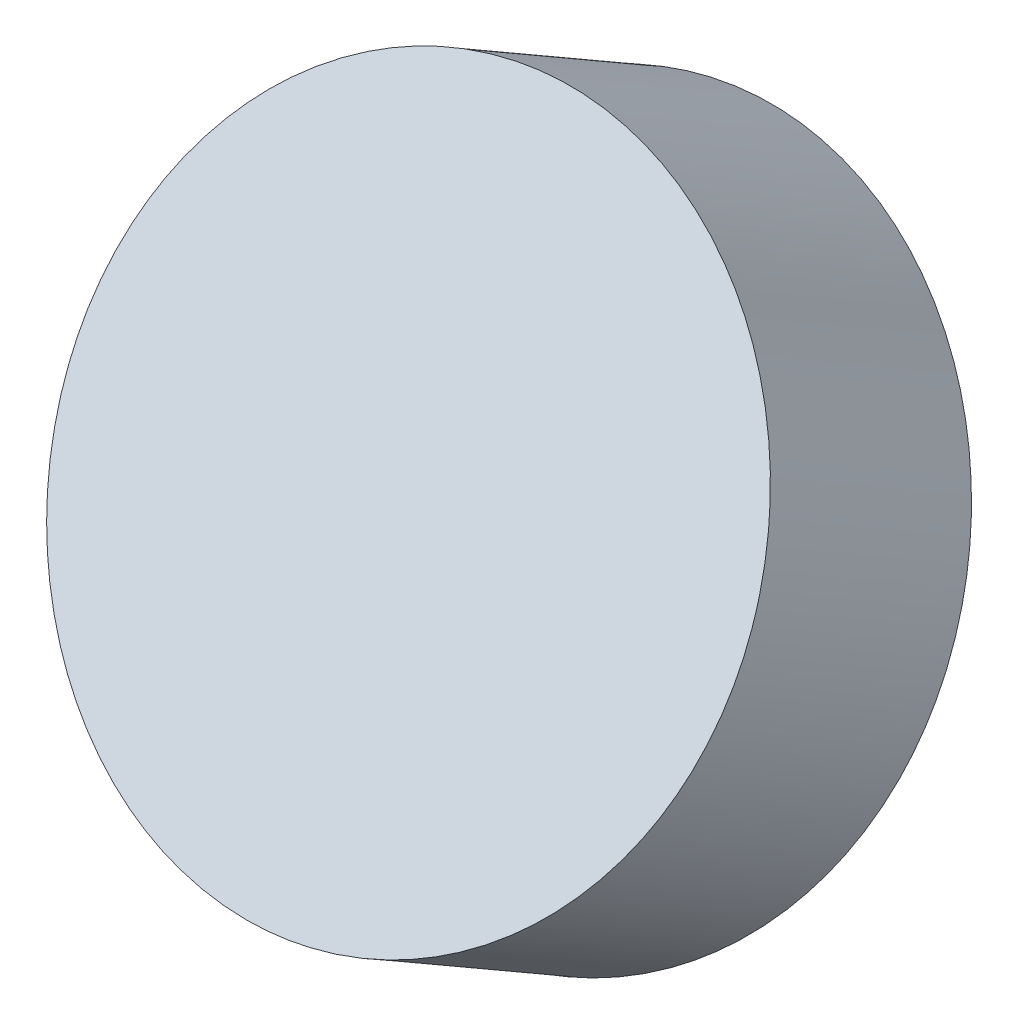
ISO-10303-21;
HEADER;
FILE_DESCRIPTION(('STEP AP214'),'2;1');
FILE_NAME('part.step','',(''),(''),'','','');
FILE_SCHEMA(('AUTOMOTIVE_DESIGN { 1 0 10303 214 1 1 1 1 }'));
ENDSEC;
DATA;
#1=APPLICATION_CONTEXT('core data for automotive mechanical design processes');
#2=APPLICATION_PROTOCOL_DEFINITION('international standard','automotive_design',2000,#1);
#3=PRODUCT_CONTEXT('',#1,'mechanical');
#4=PRODUCT('Part','Part','',(#3));
#5=PRODUCT_RELATED_PRODUCT_CATEGORY('part','',(#4));
#6=PRODUCT_DEFINITION_FORMATION('','',#4);
#7=PRODUCT_DEFINITION_CONTEXT('part definition',#1,'design');
#8=PRODUCT_DEFINITION('design','',#6,#7);
#9=PRODUCT_DEFINITION_SHAPE('','',#8);
#10=(LENGTH_UNIT() NAMED_UNIT(*) SI_UNIT(.MILLI.,.METRE.));
#11=(NAMED_UNIT(*) PLANE_ANGLE_UNIT() SI_UNIT($,.RADIAN.));
#12=(NAMED_UNIT(*) SI_UNIT($,.STERADIAN.) SOLID_ANGLE_UNIT());
#13=UNCERTAINTY_MEASURE_WITH_UNIT(LENGTH_MEASURE(1.E-05),#10,'distance_accuracy_value','');
#14=(GEOMETRIC_REPRESENTATION_CONTEXT(3) GLOBAL_UNCERTAINTY_ASSIGNED_CONTEXT((#13)) GLOBAL_UNIT_ASSIGNED_CONTEXT((#10,
#11,#12)) REPRESENTATION_CONTEXT('',''));
#15=CARTESIAN_POINT('',(0.,0.,0.));
#16=DIRECTION('',(0.,0.,1.));
#17=DIRECTION('',(1.,0.,0.));
#18=AXIS2_PLACEMENT_3D('',#15,#16,#17);
#19=CARTESIAN_POINT('',(12.5,10.6506050496707,41.4329745870571));
#20=CARTESIAN_POINT('',(12.6682299792076,10.6506050496707,41.4329745870571));
#21=CARTESIAN_POINT('',(13.0046899376229,10.7085647064236,41.3995115636287));
#22=CARTESIAN_POINT('',(13.4325454072684,10.9561474133091,41.2565696211617));
#23=CARTESIAN_POINT('',(13.7184292922025,11.3266811191702,41.0426418863389));
#24=CARTESIAN_POINT('',(13.8188183624877,11.763755426186,40.7902969175274));
#25=CARTESIAN_POINT('',(13.7184292922025,12.2008297332018,40.537951948716));
#26=CARTESIAN_POINT('',(13.4325454072684,12.571363439063,40.3240242138933));
#27=CARTESIAN_POINT('',(13.0046899376229,12.8189461459484,40.1810822714262));
#28=CARTESIAN_POINT('',(12.5,12.9058856310778,40.1308877362836));
#29=CARTESIAN_POINT('',(11.9953100623771,12.8189461459484,40.1810822714262));
#30=CARTESIAN_POINT('',(11.5674545927316,12.571363439063,40.3240242138932));
#31=CARTESIAN_POINT('',(11.2815707077975,12.2008297332018,40.537951948716));
#32=CARTESIAN_POINT('',(11.1811816375123,11.763755426186,40.7902969175274));
#33=CARTESIAN_POINT('',(11.2815707077975,11.3266811191702,41.0426418863389));
#34=CARTESIAN_POINT('',(11.5674545927316,10.9561474133091,41.2565696211617));
#35=CARTESIAN_POINT('',(11.9953100623771,10.7085647064236,41.3995115636287));
#36=CARTESIAN_POINT('',(12.3317700207924,10.6506050496707,41.4329745870571));
#37=CARTESIAN_POINT('',(12.5,10.6506050496707,41.4329745870571));
#38=B_SPLINE_CURVE_WITH_KNOTS('',3,(#19,#20,#21,#22,#23,#24,#25,#26,#27,#28,#29,#30,#31,#32,#33,
#34,#35,#36,#37),.UNSPECIFIED.,.T.,.F.,(4,1,1,1,1,1,1,1,1,1,1,1,1,1,1,1,4),(0.,
0.0624999999999998,0.125,0.1875,0.25,0.3125,0.375,0.4375,0.499999999999999,0.5625,0.625,0.6875,
0.749999999999999,0.8125,0.874999999999999,0.9375,1.),.UNSPECIFIED.);
#39=DIRECTION('',(0.,0.5,0.866025403784438));
#40=VECTOR('',#39,1.);
#41=SURFACE_OF_LINEAR_EXTRUSION('',#38,#40);
#42=CARTESIAN_POINT('',(12.5,10.6506050496707,41.4329745870571));
#43=CARTESIAN_POINT('',(12.6682299792076,10.6506050496707,41.4329745870571));
#44=CARTESIAN_POINT('',(13.0046899376229,10.7085647064236,41.3995115636287));
#45=CARTESIAN_POINT('',(13.4325454072684,10.9561474133091,41.2565696211617));
#46=CARTESIAN_POINT('',(13.7184292922025,11.3266811191702,41.0426418863389));
#47=CARTESIAN_POINT('',(13.8188183624877,11.763755426186,40.7902969175275));
#48=CARTESIAN_POINT('',(13.7184292922025,12.2008297332019,40.537951948716));
#49=CARTESIAN_POINT('',(13.4325454072684,12.571363439063,40.3240242138933));
#50=CARTESIAN_POINT('',(13.0046899376229,12.8189461459484,40.1810822714262));
#51=CARTESIAN_POINT('',(12.5,12.9058856310778,40.1308877362836));
#52=CARTESIAN_POINT('',(11.9953100623771,12.8189461459485,40.1810822714262));
#53=CARTESIAN_POINT('',(11.5674545927316,12.571363439063,40.3240242138933));
#54=CARTESIAN_POINT('',(11.2815707077975,12.2008297332018,40.537951948716));
#55=CARTESIAN_POINT('',(11.1811816375123,11.763755426186,40.7902969175275));
#56=CARTESIAN_POINT('',(11.2815707077975,11.3266811191702,41.0426418863389));
#57=CARTESIAN_POINT('',(11.5674545927316,10.9561474133091,41.2565696211617));
#58=CARTESIAN_POINT('',(11.9953100623771,10.7085647064236,41.3995115636287));
#59=CARTESIAN_POINT('',(12.3317700207924,10.6506050496707,41.4329745870571));
#60=CARTESIAN_POINT('',(12.5,10.6506050496707,41.4329745870571));
#61=B_SPLINE_CURVE_WITH_KNOTS('',3,(#42,#43,#44,#45,#46,#47,#48,#49,#50,#51,#52,#53,#54,#55,#56,
#57,#58,#59,#60),.UNSPECIFIED.,.T.,.F.,(4,1,1,1,1,1,1,1,1,1,1,1,1,1,1,1,4),(0.,
0.0624999999999998,0.125,0.1875,0.25,0.3125,0.375,0.4375,0.499999999999999,0.5625,0.625,0.6875,
0.749999999999999,0.8125,0.874999999999999,0.9375,1.),.UNSPECIFIED.);
#62=CARTESIAN_POINT('',(12.5,10.6506050496707,41.4329745870571));
#63=VERTEX_POINT('',#62);
#64=EDGE_CURVE('E10',#63,#63,#61,.T.);
#65=ORIENTED_EDGE('',*,*,#64,.T.);
#66=EDGE_LOOP('',(#65));
#67=FACE_BOUND('',#66,.T.);
#68=CARTESIAN_POINT('',(12.5,11.1116671707901,42.2315576062815));
#69=CARTESIAN_POINT('',(12.4789707564107,11.1116671576056,42.2315576138936));
#70=CARTESIAN_POINT('',(12.4579419493091,11.1121200003999,42.2312961649844));
#71=CARTESIAN_POINT('',(12.4159343530486,11.1139226360924,42.2302554127821));
#72=CARTESIAN_POINT('',(12.394955566905,11.1152724817591,42.2294760790231));
#73=CARTESIAN_POINT('',(12.3530982075204,11.1188604823901,42.2274045458929));
#74=CARTESIAN_POINT('',(12.3322196412557,11.1210986983127,42.2261123113275));
#75=CARTESIAN_POINT('',(12.2906126141021,11.1264548293302,42.2230199476427));
#76=CARTESIAN_POINT('',(12.2698841597266,11.1295727823654,42.2212197966185));
#77=CARTESIAN_POINT('',(12.2286273388163,11.1366798122586,42.2171165509965));
#78=CARTESIAN_POINT('',(12.2080989722815,11.1406688891165,42.2148134563988));
#79=CARTESIAN_POINT('',(12.167292290748,11.1495096065894,42.209709265786));
#80=CARTESIAN_POINT('',(12.1470139650022,11.1543612099931,42.2069081912549));
#81=CARTESIAN_POINT('',(12.1067573569788,11.1649184129671,42.200812987276));
#82=CARTESIAN_POINT('',(12.0867790542061,11.1706239539088,42.1975188916774));
#83=CARTESIAN_POINT('',(12.0471724169556,11.1828804745922,42.1904425861615));
#84=CARTESIAN_POINT('',(12.0275440619585,11.1894314045776,42.186660404971));
#85=CARTESIAN_POINT('',(11.9886875521215,11.2033699910939,42.1786129582937));
#86=CARTESIAN_POINT('',(11.9694593972816,11.2107576476248,42.1743476928069));
#87=CARTESIAN_POINT('',(11.93144586824,11.2263449916913,42.1653483355142));
#88=CARTESIAN_POINT('',(11.9126605201549,11.2345447269753,42.1606142161406));
#89=CARTESIAN_POINT('',(11.8755748796246,11.251731694149,42.1506913160163));
#90=CARTESIAN_POINT('',(11.8572746205572,11.2607189800459,42.1455025040845));
#91=CARTESIAN_POINT('',(11.8212015232752,11.2794565361858,42.1346843710032));
#92=CARTESIAN_POINT('',(11.8034287078442,11.2892068393223,42.1290550308626));
#93=CARTESIAN_POINT('',(11.7684528661265,11.3094459485131,42.1173699757232));
#94=CARTESIAN_POINT('',(11.7512498398399,11.3199347545674,42.1113142607242));
#95=CARTESIAN_POINT('',(11.7174559596882,11.341626400862,42.0987905828969));
#96=CARTESIAN_POINT('',(11.7008650794512,11.3528292102853,42.0923226378607));
#97=CARTESIAN_POINT('',(11.668337890586,11.3759243803242,42.0789886352217));
#98=CARTESIAN_POINT('',(11.6524015371157,11.3878166935666,42.0721226049699));
#99=CARTESIAN_POINT('',(11.6212257453276,11.4122664193867,42.0580065491861));
#100=CARTESIAN_POINT('',(11.6059862660659,11.4248237927959,42.0507565462679));
#101=CARTESIAN_POINT('',(11.5762467809678,11.4505789423863,42.0358868037189));
#102=CARTESIAN_POINT('',(11.5617467751315,11.4637767185675,42.028267064088));
#103=CARTESIAN_POINT('',(11.5335146635638,11.490775746239,42.012679168194));
#104=CARTESIAN_POINT('',(11.5197826030603,11.504577033188,42.0047109914588));
#105=CARTESIAN_POINT('',(11.4931145977823,11.532746405059,41.9884473970262));
#106=CARTESIAN_POINT('',(11.4801787077099,11.5471145288153,41.9801519569077));
#107=CARTESIAN_POINT('',(11.4551313520553,11.5763808875191,41.9632550168319));
#108=CARTESIAN_POINT('',(11.4430199220574,11.5912791453054,41.9546535036886));
#109=CARTESIAN_POINT('',(11.4196498117784,11.6215691127516,41.9371655828298));
#110=CARTESIAN_POINT('',(11.4083911314974,11.6369608224115,41.9282791751143));
#111=CARTESIAN_POINT('',(11.3867548653347,11.6682010410511,41.9102426264732));
#112=CARTESIAN_POINT('',(11.376377241471,11.6840495302997,41.9010924969393));
#113=CARTESIAN_POINT('',(11.3565314412224,11.7161666371137,41.8825496766746));
#114=CARTESIAN_POINT('',(11.3470632024753,11.7324352257732,41.8731570026327));
#115=CARTESIAN_POINT('',(11.32906448789,11.7653559076138,41.8541502381101));
#116=CARTESIAN_POINT('',(11.3205339569167,11.7820079781773,41.8445361606877));
#117=CARTESIAN_POINT('',(11.3044390635613,11.8156587027869,41.8251079057759));
#118=CARTESIAN_POINT('',(11.2968747011792,11.8326573568331,41.8152937282865));
#119=CARTESIAN_POINT('',(11.2827220901504,11.8669577108938,41.7954904096363));
#120=CARTESIAN_POINT('',(11.2761338989574,11.8842594286786,41.7855012582158));
#121=CARTESIAN_POINT('',(11.2639434909883,11.9191226737355,41.7653729542974));
#122=CARTESIAN_POINT('',(11.2583413419106,11.9366842187568,41.7552337915519));
#123=CARTESIAN_POINT('',(11.2481329607271,11.972023842212,41.734830450437));
#124=CARTESIAN_POINT('',(11.2435267715891,11.9898019299531,41.724566266694));
#125=CARTESIAN_POINT('',(11.2353202801882,12.0255313826902,41.7039378575383));
#126=CARTESIAN_POINT('',(11.2317199779253,12.0434827476863,41.6935736321254));
#127=CARTESIAN_POINT('',(11.2255352511417,12.0795154985763,41.6727701136994));
#128=CARTESIAN_POINT('',(11.2229507828111,12.0975968788289,41.6623308239433));
#129=CARTESIAN_POINT('',(11.2188077143643,12.1338463840479,41.6414021623471));
#130=CARTESIAN_POINT('',(11.2172490438598,12.1520145029762,41.6309127939931));
#131=CARTESIAN_POINT('',(11.2151675476143,12.1883942654538,41.6099089283337));
#132=CARTESIAN_POINT('',(11.2146446609407,12.2066059063796,41.5993944325427));
#133=CARTESIAN_POINT('',(11.2146446609407,12.2430291882313,41.5783654409609));
#134=CARTESIAN_POINT('',(11.2151675476143,12.2612408291571,41.56785094517));
#135=CARTESIAN_POINT('',(11.2172490438598,12.2976205916347,41.5468470795105));
#136=CARTESIAN_POINT('',(11.2188077143643,12.3157887105631,41.5363577111566));
#137=CARTESIAN_POINT('',(11.2229507828111,12.352038215782,41.5154290495604));
#138=CARTESIAN_POINT('',(11.2255352511417,12.3701195960346,41.5049897598043));
#139=CARTESIAN_POINT('',(11.2317199779253,12.4061523469247,41.4841862413782));
#140=CARTESIAN_POINT('',(11.2353202801882,12.4241037119208,41.4738220159654));
#141=CARTESIAN_POINT('',(11.2435267715891,12.4598331646579,41.4531936068096));
#142=CARTESIAN_POINT('',(11.2481329607271,12.4776112523989,41.4429294230667));
#143=CARTESIAN_POINT('',(11.2583413419106,12.5129508758542,41.4225260819517));
#144=CARTESIAN_POINT('',(11.2639434909883,12.5305124208755,41.4123869192063));
#145=CARTESIAN_POINT('',(11.2761338989574,12.5653756659324,41.3922586152879));
#146=CARTESIAN_POINT('',(11.2827220901504,12.5826773837172,41.3822694638674));
#147=CARTESIAN_POINT('',(11.2968747011792,12.6169777377779,41.3624661452171));
#148=CARTESIAN_POINT('',(11.3044390635613,12.633976391824,41.3526519677277));
#149=CARTESIAN_POINT('',(11.3205339569167,12.6676271164337,41.3332237128159));
#150=CARTESIAN_POINT('',(11.32906448789,12.6842791869972,41.3236096353935));
#151=CARTESIAN_POINT('',(11.3470632024752,12.7171998688378,41.304602870871));
#152=CARTESIAN_POINT('',(11.3565314412224,12.7334684574972,41.2952101968291));
#153=CARTESIAN_POINT('',(11.376377241471,12.7655855643113,41.2766673765644));
#154=CARTESIAN_POINT('',(11.3867548653347,12.7814340535598,41.2675172470305));
#155=CARTESIAN_POINT('',(11.4083911314974,12.8126742721994,41.2494806983894));
#156=CARTESIAN_POINT('',(11.4196498117784,12.8280659818594,41.2405942906739));
#157=CARTESIAN_POINT('',(11.4430199220574,12.8583559493056,41.2231063698151));
#158=CARTESIAN_POINT('',(11.4551313520553,12.8732542070918,41.2145048566718));
#159=CARTESIAN_POINT('',(11.4801787077099,12.9025205657956,41.1976079165959));
#160=CARTESIAN_POINT('',(11.4931145977823,12.916888689552,41.1893124764774));
#161=CARTESIAN_POINT('',(11.5197826030603,12.945058061423,41.1730488820448));
#162=CARTESIAN_POINT('',(11.5335146635638,12.9588593483719,41.1650807053097));
#163=CARTESIAN_POINT('',(11.5617467751315,12.9858583760435,41.1494928094156));
#164=CARTESIAN_POINT('',(11.5762467809678,12.9990561522246,41.1418730697848));
#165=CARTESIAN_POINT('',(11.6059862660658,13.024811301815,41.1270033272357));
#166=CARTESIAN_POINT('',(11.6212257453276,13.0373686752243,41.1197533243176));
#167=CARTESIAN_POINT('',(11.6524015371157,13.0618184010444,41.1056372685337));
#168=CARTESIAN_POINT('',(11.668337890586,13.0737107142867,41.098771238282));
#169=CARTESIAN_POINT('',(11.7008650794512,13.0968058843257,41.085437235643));
#170=CARTESIAN_POINT('',(11.7174559596882,13.108008693749,41.0789692906068));
#171=CARTESIAN_POINT('',(11.7512498398399,13.1297003400435,41.0664456127795));
#172=CARTESIAN_POINT('',(11.7684528661265,13.1401891460978,41.0603898977805));
#173=CARTESIAN_POINT('',(11.8034287078442,13.1604282552887,41.048704842641));
#174=CARTESIAN_POINT('',(11.8212015232751,13.1701785584252,41.0430755025005));
#175=CARTESIAN_POINT('',(11.8572746205573,13.1889161145651,41.0322573694192));
#176=CARTESIAN_POINT('',(11.8755748796251,13.1979034004619,41.0270685574873));
#177=CARTESIAN_POINT('',(11.9126605201545,13.2150903676357,41.017145657363));
#178=CARTESIAN_POINT('',(11.9314458682382,13.2232901029198,41.0124115379895));
#179=CARTESIAN_POINT('',(11.9694593972834,13.238877446986,41.0034121806969));
#180=CARTESIAN_POINT('',(11.9886875521282,13.2462651035167,40.9991469152102));
#181=CARTESIAN_POINT('',(12.0275440619518,13.2602036900337,40.9910994685325));
#182=CARTESIAN_POINT('',(12.0471724169306,13.26675462002,40.9873172873414));
#183=CARTESIAN_POINT('',(12.0867790542311,13.2790111407009,40.980240981827));
#184=CARTESIAN_POINT('',(12.1067573570721,13.284716681639,40.9769468862305));
#185=CARTESIAN_POINT('',(12.1470139649089,13.2952738846227,40.970851682246));
#186=CARTESIAN_POINT('',(12.1672922903998,13.3001254880398,40.9680506077071));
#187=CARTESIAN_POINT('',(12.2080989726297,13.3089662054762,40.9629464171154));
#188=CARTESIAN_POINT('',(12.2286273401156,13.3129552822844,40.9606433225464));
#189=CARTESIAN_POINT('',(12.2698841584272,13.3200623123135,40.9565400768459));
#190=CARTESIAN_POINT('',(12.2906126092528,13.3231802655344,40.9547399257145));
#191=CARTESIAN_POINT('',(12.3322196461048,13.3285363960446,40.9516475623227));
#192=CARTESIAN_POINT('',(12.3530982256172,13.3307746112741,40.9503553281574));
#193=CARTESIAN_POINT('',(12.3949555488095,13.3343626137986,40.948283793934));
#194=CARTESIAN_POINT('',(12.4159342855174,13.3357124620516,40.9475044586817));
#195=CARTESIAN_POINT('',(12.4579420168363,13.3375150906781,40.946463710559));
#196=CARTESIAN_POINT('',(12.4789710084182,13.3379679238208,40.9462022672222));
#197=CARTESIAN_POINT('',(12.5210289915818,13.3379679238208,40.9462022672222));
#198=CARTESIAN_POINT('',(12.5420579831637,13.3375150906781,40.946463710559));
#199=CARTESIAN_POINT('',(12.5840657144826,13.3357124620516,40.9475044586817));
#200=CARTESIAN_POINT('',(12.6050444511905,13.3343626137986,40.948283793934));
#201=CARTESIAN_POINT('',(12.6469017743828,13.3307746112741,40.9503553281574));
#202=CARTESIAN_POINT('',(12.6677803538952,13.3285363960446,40.9516475623227));
#203=CARTESIAN_POINT('',(12.7093873907472,13.3231802655344,40.9547399257145));
#204=CARTESIAN_POINT('',(12.7301158415728,13.3200623123135,40.9565400768459));
#205=CARTESIAN_POINT('',(12.7713726598844,13.3129552822844,40.9606433225464));
#206=CARTESIAN_POINT('',(12.7919010273703,13.3089662054762,40.9629464171154));
#207=CARTESIAN_POINT('',(12.8327077096002,13.3001254880398,40.9680506077071));
#208=CARTESIAN_POINT('',(12.8529860350911,13.2952738846227,40.970851682246));
#209=CARTESIAN_POINT('',(12.8932426429279,13.284716681639,40.9769468862305));
#210=CARTESIAN_POINT('',(12.9132209457689,13.2790111407009,40.980240981827));
#211=CARTESIAN_POINT('',(12.9528275830694,13.26675462002,40.9873172873414));
#212=CARTESIAN_POINT('',(12.9724559380482,13.2602036900337,40.9910994685325));
#213=CARTESIAN_POINT('',(13.0113124478718,13.2462651035167,40.9991469152102));
#214=CARTESIAN_POINT('',(13.0305406027166,13.238877446986,41.0034121806968));
#215=CARTESIAN_POINT('',(13.0685541317618,13.2232901029198,41.0124115379895));
#216=CARTESIAN_POINT('',(13.0873394798455,13.2150903676357,41.017145657363));
#217=CARTESIAN_POINT('',(13.1244251203749,13.1979034004619,41.0270685574873));
#218=CARTESIAN_POINT('',(13.1427253794427,13.1889161145651,41.0322573694192));
#219=CARTESIAN_POINT('',(13.1787984767249,13.1701785584252,41.0430755025005));
#220=CARTESIAN_POINT('',(13.1965712921558,13.1604282552887,41.048704842641));
#221=CARTESIAN_POINT('',(13.2315471338735,13.1401891460978,41.0603898977805));
#222=CARTESIAN_POINT('',(13.2487501601601,13.1297003400435,41.0664456127795));
#223=CARTESIAN_POINT('',(13.2825440403118,13.108008693749,41.0789692906068));
#224=CARTESIAN_POINT('',(13.2991349205488,13.0968058843257,41.085437235643));
#225=CARTESIAN_POINT('',(13.331662109414,13.0737107142867,41.098771238282));
#226=CARTESIAN_POINT('',(13.3475984628843,13.0618184010444,41.1056372685337));
#227=CARTESIAN_POINT('',(13.3787742546724,13.0373686752243,41.1197533243176));
#228=CARTESIAN_POINT('',(13.3940137339341,13.024811301815,41.1270033272357));
#229=CARTESIAN_POINT('',(13.4237532190322,12.9990561522246,41.1418730697848));
#230=CARTESIAN_POINT('',(13.4382532248685,12.9858583760435,41.1494928094156));
#231=CARTESIAN_POINT('',(13.4664853364362,12.9588593483719,41.1650807053097));
#232=CARTESIAN_POINT('',(13.4802173969397,12.945058061423,41.1730488820448));
#233=CARTESIAN_POINT('',(13.5068854022177,12.916888689552,41.1893124764775));
#234=CARTESIAN_POINT('',(13.5198212922901,12.9025205657956,41.1976079165959));
#235=CARTESIAN_POINT('',(13.5448686479447,12.8732542070918,41.2145048566718));
#236=CARTESIAN_POINT('',(13.5569800779426,12.8583559493056,41.2231063698151));
#237=CARTESIAN_POINT('',(13.5803501882216,12.8280659818594,41.2405942906739));
#238=CARTESIAN_POINT('',(13.5916088685026,12.8126742721994,41.2494806983894));
#239=CARTESIAN_POINT('',(13.6132451346653,12.7814340535598,41.2675172470305));
#240=CARTESIAN_POINT('',(13.623622758529,12.7655855643113,41.2766673765644));
#241=CARTESIAN_POINT('',(13.6434685587776,12.7334684574972,41.2952101968291));
#242=CARTESIAN_POINT('',(13.6529367975248,12.7171998688378,41.3046028708709));
#243=CARTESIAN_POINT('',(13.67093551211,12.6842791869972,41.3236096353935));
#244=CARTESIAN_POINT('',(13.6794660430833,12.6676271164337,41.3332237128159));
#245=CARTESIAN_POINT('',(13.6955609364387,12.633976391824,41.3526519677277));
#246=CARTESIAN_POINT('',(13.7031252988208,12.6169777377779,41.3624661452171));
#247=CARTESIAN_POINT('',(13.7172779098496,12.5826773837172,41.3822694638674));
#248=CARTESIAN_POINT('',(13.7238661010426,12.5653756659324,41.3922586152879));
#249=CARTESIAN_POINT('',(13.7360565090117,12.5305124208755,41.4123869192063));
#250=CARTESIAN_POINT('',(13.7416586580894,12.5129508758542,41.4225260819517));
#251=CARTESIAN_POINT('',(13.7518670392729,12.4776112523989,41.4429294230667));
#252=CARTESIAN_POINT('',(13.7564732284109,12.4598331646579,41.4531936068096));
#253=CARTESIAN_POINT('',(13.7646797198118,12.4241037119208,41.4738220159654));
#254=CARTESIAN_POINT('',(13.7682800220747,12.4061523469247,41.4841862413782));
#255=CARTESIAN_POINT('',(13.7744647488583,12.3701195960346,41.5049897598043));
#256=CARTESIAN_POINT('',(13.7770492171889,12.352038215782,41.5154290495604));
#257=CARTESIAN_POINT('',(13.7811922856357,12.3157887105631,41.5363577111566));
#258=CARTESIAN_POINT('',(13.7827509561402,12.2976205916347,41.5468470795105));
#259=CARTESIAN_POINT('',(13.7848324523857,12.2612408291571,41.56785094517));
#260=CARTESIAN_POINT('',(13.7853553390593,12.2430291882313,41.5783654409609));
#261=CARTESIAN_POINT('',(13.7853553390593,12.2066059063796,41.5993944325427));
#262=CARTESIAN_POINT('',(13.7848324523857,12.1883942654538,41.6099089283337));
#263=CARTESIAN_POINT('',(13.7827509561402,12.1520145029762,41.6309127939931));
#264=CARTESIAN_POINT('',(13.7811922856357,12.1338463840479,41.6414021623471));
#265=CARTESIAN_POINT('',(13.7770492171889,12.0975968788289,41.6623308239433));
#266=CARTESIAN_POINT('',(13.7744647488584,12.0795154985763,41.6727701136994));
#267=CARTESIAN_POINT('',(13.7682800220747,12.0434827476863,41.6935736321254));
#268=CARTESIAN_POINT('',(13.7646797198118,12.0255313826902,41.7039378575382));
#269=CARTESIAN_POINT('',(13.7564732284109,11.9898019299531,41.724566266694));
#270=CARTESIAN_POINT('',(13.7518670392729,11.972023842212,41.734830450437));
#271=CARTESIAN_POINT('',(13.7416586580894,11.9366842187568,41.7552337915519));
#272=CARTESIAN_POINT('',(13.7360565090117,11.9191226737355,41.7653729542974));
#273=CARTESIAN_POINT('',(13.7238661010426,11.8842594286786,41.7855012582158));
#274=CARTESIAN_POINT('',(13.7172779098496,11.8669577108938,41.7954904096363));
#275=CARTESIAN_POINT('',(13.7031252988208,11.8326573568331,41.8152937282865));
#276=CARTESIAN_POINT('',(13.6955609364387,11.8156587027869,41.8251079057759));
#277=CARTESIAN_POINT('',(13.6794660430833,11.7820079781773,41.8445361606877));
#278=CARTESIAN_POINT('',(13.67093551211,11.7653559076138,41.8541502381101));
#279=CARTESIAN_POINT('',(13.6529367975248,11.7324352257732,41.8731570026327));
#280=CARTESIAN_POINT('',(13.6434685587776,11.7161666371137,41.8825496766746));
#281=CARTESIAN_POINT('',(13.623622758529,11.6840495302997,41.9010924969393));
#282=CARTESIAN_POINT('',(13.6132451346653,11.6682010410511,41.9102426264732));
#283=CARTESIAN_POINT('',(13.5916088685027,11.6369608224115,41.9282791751143));
#284=CARTESIAN_POINT('',(13.5803501882216,11.6215691127516,41.9371655828298));
#285=CARTESIAN_POINT('',(13.5569800779426,11.5912791453054,41.9546535036886));
#286=CARTESIAN_POINT('',(13.5448686479447,11.5763808875191,41.9632550168319));
#287=CARTESIAN_POINT('',(13.5198212922901,11.5471145288153,41.9801519569077));
#288=CARTESIAN_POINT('',(13.5068854022177,11.532746405059,41.9884473970262));
#289=CARTESIAN_POINT('',(13.4802173969397,11.504577033188,42.0047109914588));
#290=CARTESIAN_POINT('',(13.4664853364362,11.490775746239,42.012679168194));
#291=CARTESIAN_POINT('',(13.4382532248685,11.4637767185675,42.028267064088));
#292=CARTESIAN_POINT('',(13.4237532190322,11.4505789423863,42.0358868037189));
#293=CARTESIAN_POINT('',(13.3940137339342,11.4248237927959,42.0507565462679));
#294=CARTESIAN_POINT('',(13.3787742546724,11.4122664193867,42.0580065491861));
#295=CARTESIAN_POINT('',(13.3475984628843,11.3878166935666,42.0721226049699));
#296=CARTESIAN_POINT('',(13.331662109414,11.3759243803242,42.0789886352217));
#297=CARTESIAN_POINT('',(13.2991349205488,11.3528292102853,42.0923226378607));
#298=CARTESIAN_POINT('',(13.2825440403118,11.341626400862,42.0987905828969));
#299=CARTESIAN_POINT('',(13.2487501601601,11.3199347545674,42.1113142607242));
#300=CARTESIAN_POINT('',(13.2315471338735,11.3094459485131,42.1173699757232));
#301=CARTESIAN_POINT('',(13.1965712921558,11.2892068393223,42.1290550308626));
#302=CARTESIAN_POINT('',(13.1787984767248,11.2794565361858,42.1346843710032));
#303=CARTESIAN_POINT('',(13.1427253794428,11.2607189800459,42.1455025040845));
#304=CARTESIAN_POINT('',(13.1244251203754,11.251731694149,42.1506913160163));
#305=CARTESIAN_POINT('',(13.0873394798451,11.2345447269753,42.1606142161406));
#306=CARTESIAN_POINT('',(13.06855413176,11.2263449916913,42.1653483355142));
#307=CARTESIAN_POINT('',(13.0305406027184,11.2107576476248,42.1743476928069));
#308=CARTESIAN_POINT('',(13.0113124478785,11.2033699910939,42.1786129582937));
#309=CARTESIAN_POINT('',(12.9724559380415,11.1894314045776,42.186660404971));
#310=CARTESIAN_POINT('',(12.9528275830444,11.1828804745922,42.1904425861615));
#311=CARTESIAN_POINT('',(12.9132209457939,11.1706239539088,42.1975188916774));
#312=CARTESIAN_POINT('',(12.8932426430212,11.1649184129671,42.200812987276));
#313=CARTESIAN_POINT('',(12.8529860349978,11.1543612099931,42.2069081912549));
#314=CARTESIAN_POINT('',(12.832707709252,11.1495096065894,42.209709265786));
#315=CARTESIAN_POINT('',(12.7919010277185,11.1406688891165,42.2148134563988));
#316=CARTESIAN_POINT('',(12.7713726611837,11.1366798122586,42.2171165509965));
#317=CARTESIAN_POINT('',(12.7301158402734,11.1295727823654,42.2212197966185));
#318=CARTESIAN_POINT('',(12.7093873858979,11.1264548293302,42.2230199476427));
#319=CARTESIAN_POINT('',(12.6677803587443,11.1210986983127,42.2261123113275));
#320=CARTESIAN_POINT('',(12.6469017924796,11.1188604823901,42.2274045458929));
#321=CARTESIAN_POINT('',(12.605044433095,11.1152724817591,42.2294760790231));
#322=CARTESIAN_POINT('',(12.5840656469514,11.1139226360924,42.2302554127821));
#323=CARTESIAN_POINT('',(12.5420580506909,11.1121200003999,42.2312961649844));
#324=CARTESIAN_POINT('',(12.5210292435893,11.1116671576056,42.2315576138936));
#325=CARTESIAN_POINT('',(12.5,11.1116671707901,42.2315576062815));
#326=B_SPLINE_CURVE_WITH_KNOTS('',3,(#68,#69,#70,#71,#72,#73,#74,#75,#76,#77,#78,#79,#80,#81,
#82,#83,#84,#85,#86,#87,#88,#89,#90,#91,#92,#93,#94,#95,#96,#97,#98,#99,#100,#101,#102,#103,
#104,#105,#106,#107,#108,#109,#110,#111,#112,#113,#114,#115,#116,#117,#118,#119,#120,#121,#122,
#123,#124,#125,#126,#127,#128,#129,#130,#131,#132,#133,#134,#135,#136,#137,#138,#139,#140,#141,
#142,#143,#144,#145,#146,#147,#148,#149,#150,#151,#152,#153,#154,#155,#156,#157,#158,#159,#160,
#161,#162,#163,#164,#165,#166,#167,#168,#169,#170,#171,#172,#173,#174,#175,#176,#177,#178,#179,
#180,#181,#182,#183,#184,#185,#186,#187,#188,#189,#190,#191,#192,#193,#194,#195,#196,#197,#198,
#199,#200,#201,#202,#203,#204,#205,#206,#207,#208,#209,#210,#211,#212,#213,#214,#215,#216,#217,
#218,#219,#220,#221,#222,#223,#224,#225,#226,#227,#228,#229,#230,#231,#232,#233,#234,#235,#236,
#237,#238,#239,#240,#241,#242,#243,#244,#245,#246,#247,#248,#249,#250,#251,#252,#253,#254,#255,
#256,#257,#258,#259,#260,#261,#262,#263,#264,#265,#266,#267,#268,#269,#270,#271,#272,#273,#274,
#275,#276,#277,#278,#279,#280,#281,#282,#283,#284,#285,#286,#287,#288,#289,#290,#291,#292,#293,
#294,#295,#296,#297,#298,#299,#300,#301,#302,#303,#304,#305,#306,#307,#308,#309,#310,#311,#312,
#313,#314,#315,#316,#317,#318,#319,#320,#321,#322,#323,#324,#325),.UNSPECIFIED.,.F.,.F.,(4,2,2,
2,2,2,2,2,2,2,2,2,2,2,2,2,2,2,2,2,2,2,2,2,2,2,2,2,2,2,2,2,2,2,2,2,2,2,2,2,2,2,2,2,2,2,2,2,2,2,2,
2,2,2,2,2,2,2,2,2,2,2,2,2,2,2,2,2,2,2,2,2,2,2,2,2,2,2,2,2,2,2,2,2,2,2,2,2,2,2,2,2,2,2,2,2,2,2,2,
2,2,2,2,2,2,2,2,2,2,2,2,2,2,2,2,2,2,2,2,2,2,2,2,2,2,2,2,2,4),(0.,0.0630806127990756,
0.126164936809588,0.189253590290845,0.252344965001649,0.315436339712455,0.378524993193713,
0.441609317204222,0.5046899300033,0.567770542802377,0.630854866812886,0.693943520294144,
0.757034895004951,0.820126269715759,0.883214923197018,0.946299247207527,1.0093798600066,
1.07246047280568,1.13554479681619,1.19863345029745,1.26172482500826,1.32481619971906,
1.38790485320032,1.45098917721083,1.51406979000991,1.57715040280898,1.64023472681949,
1.70332338030076,1.76641475501155,1.82950612972237,1.89259478320363,1.95567910721414,
2.01875972001321,2.08184033281228,2.1449246568228,2.20801331030406,2.27110468501486,
2.33419605972567,2.39728471320693,2.46036903721744,2.52344965001652,2.58653026281559,
2.6496145868261,2.71270324030737,2.77579461501817,2.83888598972897,2.90197464321023,
2.96505896722074,3.02813958001982,3.0912201928189,3.15430451682941,3.21739317031067,
3.28048454502147,3.34357591973228,3.40666457321354,3.46974889722405,3.53282951002313,
3.5959101228222,3.65899444683271,3.72208310031397,3.78517447502478,3.84826584973558,
3.91135450321684,3.97443882722735,4.03751944002643,4.10060005282551,4.16368437683602,
4.22677303031728,4.28986440502808,4.35295577973889,4.41604443322015,4.47912875723066,
4.54220937002973,4.60528998282881,4.66837430683932,4.73146296032058,4.79455433503139,
4.85764570974219,4.92073436322345,4.98381868723397,5.04689930003304,5.10997991283212,
5.17306423684263,5.23615289032389,5.29924426503469,5.3623356397455,5.42542429322676,
5.48850861723726,5.55158923003634,5.61466984283542,5.67775416684593,5.74084282032719,
5.803934195038,5.8670255697488,5.93011422323006,5.99319854724057,6.05627916003965,
6.11935977283873,6.18244409684924,6.24553275033049,6.3086241250413,6.37171549975211,
6.43480415323337,6.49788847724387,6.56096909004295,6.62404970284203,6.68713402685254,
6.7502226803338,6.81331405504461,6.87640542975541,6.93949408323667,7.00257840724718,
7.06565902004626,7.12873963284533,7.19182395685584,7.2549126103371,7.31800398504791,
7.38109535975872,7.44418401323997,7.50726833725048,7.57034895004956,7.63342956284864,
7.69651388685915,7.75960254034041,7.82269391505122,7.88578528976202,7.94887394324328,
8.01195826725379,8.07503888005287),.UNSPECIFIED.);
#327=CARTESIAN_POINT('',(12.5,11.1116671707901,42.2315576062815));
#328=VERTEX_POINT('',#327);
#329=EDGE_CURVE('E25',#328,#328,#326,.F.);
#330=ORIENTED_EDGE('',*,*,#329,.F.);
#331=EDGE_LOOP('',(#330));
#332=FACE_BOUND('',#331,.T.);
#333=ADVANCED_FACE('F15',(#67,#332),#41,.T.);
#334=CARTESIAN_POINT('',(-13.7495895867941,0.969446799073534,47.0223939091068));
#335=DIRECTION('',(0.,0.5,0.866025403784438));
#336=DIRECTION('',(-1.,0.,0.));
#337=AXIS2_PLACEMENT_3D('',#334,#335,#336);
#338=PLANE('',#337);
#339=ORIENTED_EDGE('',*,*,#64,.F.);
#340=EDGE_LOOP('',(#339));
#341=FACE_BOUND('',#340,.T.);
#342=ADVANCED_FACE('F63',(#341),#338,.F.);
#343=CARTESIAN_POINT('',(-13.7495895867941,1.43050892019299,47.8209769283311));
#344=DIRECTION('',(0.,0.5,0.866025403784438));
#345=DIRECTION('',(-1.,0.,0.));
#346=AXIS2_PLACEMENT_3D('',#343,#344,#345);
#347=PLANE('',#346);
#348=ORIENTED_EDGE('',*,*,#329,.T.);
#349=EDGE_LOOP('',(#348));
#350=FACE_BOUND('',#349,.T.);
#351=ADVANCED_FACE('F32',(#350),#347,.T.);
#352=CLOSED_SHELL('',(#333,#342,#351));
#353=MANIFOLD_SOLID_BREP('B1',#352);
#354=ADVANCED_BREP_SHAPE_REPRESENTATION('',(#18,#353),#14);
#355=SHAPE_DEFINITION_REPRESENTATION(#9,#354);
ENDSEC;
END-ISO-10303-21;
